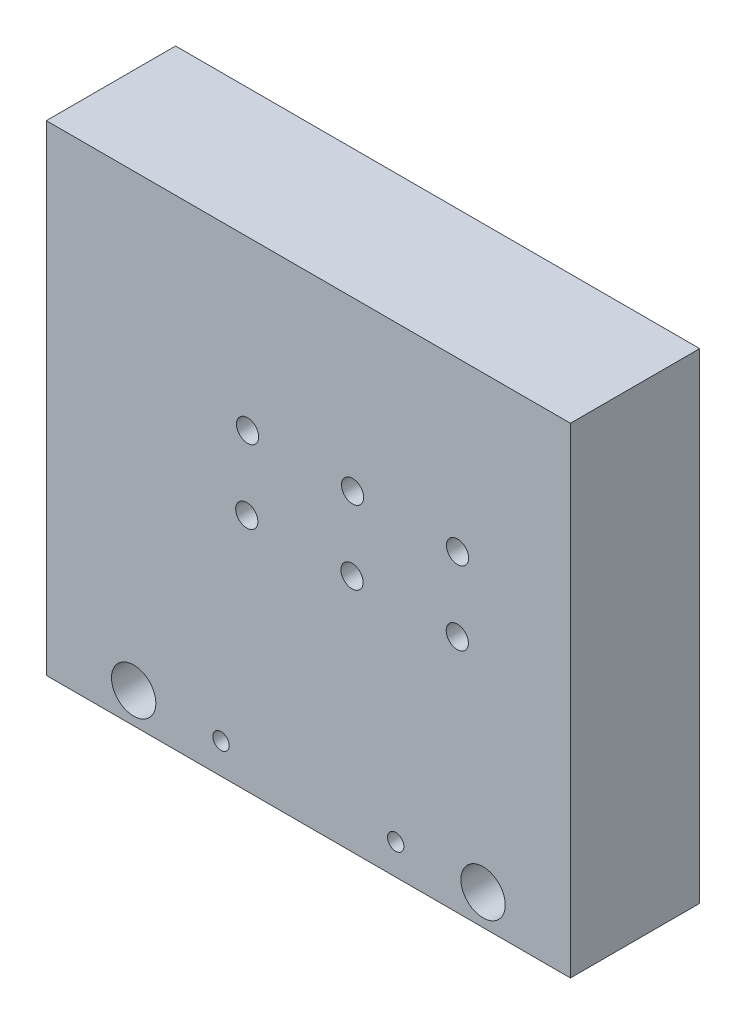
ISO-10303-21;
HEADER;
FILE_DESCRIPTION(('STEP AP214'),'2;1');
FILE_NAME('part.step','',(''),(''),'','','');
FILE_SCHEMA(('AUTOMOTIVE_DESIGN { 1 0 10303 214 1 1 1 1 }'));
ENDSEC;
DATA;
#1=APPLICATION_CONTEXT('core data for automotive mechanical design processes');
#2=APPLICATION_PROTOCOL_DEFINITION('international standard','automotive_design',2000,#1);
#3=PRODUCT_CONTEXT('',#1,'mechanical');
#4=PRODUCT('Part','Part','',(#3));
#5=PRODUCT_RELATED_PRODUCT_CATEGORY('part','',(#4));
#6=PRODUCT_DEFINITION_FORMATION('','',#4);
#7=PRODUCT_DEFINITION_CONTEXT('part definition',#1,'design');
#8=PRODUCT_DEFINITION('design','',#6,#7);
#9=PRODUCT_DEFINITION_SHAPE('','',#8);
#10=(LENGTH_UNIT() NAMED_UNIT(*) SI_UNIT(.MILLI.,.METRE.));
#11=(NAMED_UNIT(*) PLANE_ANGLE_UNIT() SI_UNIT($,.RADIAN.));
#12=(NAMED_UNIT(*) SI_UNIT($,.STERADIAN.) SOLID_ANGLE_UNIT());
#13=UNCERTAINTY_MEASURE_WITH_UNIT(LENGTH_MEASURE(1.E-05),#10,'distance_accuracy_value','');
#14=(GEOMETRIC_REPRESENTATION_CONTEXT(3) GLOBAL_UNCERTAINTY_ASSIGNED_CONTEXT((#13)) GLOBAL_UNIT_ASSIGNED_CONTEXT((#10,
#11,#12)) REPRESENTATION_CONTEXT('',''));
#15=CARTESIAN_POINT('',(0.,0.,0.));
#16=DIRECTION('',(0.,0.,1.));
#17=DIRECTION('',(1.,0.,0.));
#18=AXIS2_PLACEMENT_3D('',#15,#16,#17);
#19=CARTESIAN_POINT('',(0.,0.,74.));
#20=DIRECTION('',(0.,0.,1.));
#21=DIRECTION('',(1.,0.,0.));
#22=AXIS2_PLACEMENT_3D('',#19,#20,#21);
#23=PLANE('',#22);
#24=CARTESIAN_POINT('',(235.249999999999,136.750000000002,74.));
#25=DIRECTION('',(0.,0.,-1.));
#26=DIRECTION('',(-1.,0.,0.));
#27=AXIS2_PLACEMENT_3D('',#24,#25,#26);
#28=CIRCLE('',#27,6.34999999999999);
#29=CARTESIAN_POINT('',(228.899999999999,136.750000000002,74.));
#30=VERTEX_POINT('',#29);
#31=EDGE_CURVE('E486',#30,#30,#28,.T.);
#32=ORIENTED_EDGE('',*,*,#31,.T.);
#33=EDGE_LOOP('',(#32));
#34=FACE_BOUND('',#33,.T.);
#35=CARTESIAN_POINT('',(235.403635347868,178.999720663929,74.));
#36=DIRECTION('',(0.,0.,-1.));
#37=DIRECTION('',(-1.,0.,0.));
#38=AXIS2_PLACEMENT_3D('',#35,#36,#37);
#39=CIRCLE('',#38,6.34999999999999);
#40=CARTESIAN_POINT('',(229.053635347868,178.999720663929,74.));
#41=VERTEX_POINT('',#40);
#42=EDGE_CURVE('E497',#41,#41,#39,.T.);
#43=ORIENTED_EDGE('',*,*,#42,.T.);
#44=EDGE_LOOP('',(#43));
#45=FACE_BOUND('',#44,.T.);
#46=CARTESIAN_POINT('',(175.307264601373,178.998882688952,74.));
#47=DIRECTION('',(0.,0.,-1.));
#48=DIRECTION('',(-1.,0.,0.));
#49=AXIS2_PLACEMENT_3D('',#46,#47,#48);
#50=CIRCLE('',#49,6.34999999999999);
#51=CARTESIAN_POINT('',(168.957264601373,178.998882688952,74.));
#52=VERTEX_POINT('',#51);
#53=EDGE_CURVE('E469',#52,#52,#50,.T.);
#54=ORIENTED_EDGE('',*,*,#53,.T.);
#55=EDGE_LOOP('',(#54));
#56=FACE_BOUND('',#55,.T.);
#57=CARTESIAN_POINT('',(115.21088166736,178.997486174786,74.));
#58=DIRECTION('',(0.,0.,-1.));
#59=DIRECTION('',(-1.,0.,0.));
#60=AXIS2_PLACEMENT_3D('',#57,#58,#59);
#61=CIRCLE('',#60,6.34999999999999);
#62=CARTESIAN_POINT('',(108.86088166736,178.997486174786,74.));
#63=VERTEX_POINT('',#62);
#64=EDGE_CURVE('E470',#63,#63,#61,.T.);
#65=ORIENTED_EDGE('',*,*,#64,.T.);
#66=EDGE_LOOP('',(#65));
#67=FACE_BOUND('',#66,.T.);
#68=CARTESIAN_POINT('',(114.749999999999,136.750000000001,74.));
#69=DIRECTION('',(0.,0.,-1.));
#70=DIRECTION('',(-1.,0.,0.));
#71=AXIS2_PLACEMENT_3D('',#68,#69,#70);
#72=CIRCLE('',#71,6.34999999999999);
#73=CARTESIAN_POINT('',(108.399999999999,136.750000000001,74.));
#74=VERTEX_POINT('',#73);
#75=EDGE_CURVE('E492',#74,#74,#72,.T.);
#76=ORIENTED_EDGE('',*,*,#75,.T.);
#77=EDGE_LOOP('',(#76));
#78=FACE_BOUND('',#77,.T.);
#79=CARTESIAN_POINT('',(174.999999999999,136.750000000001,74.));
#80=DIRECTION('',(0.,0.,-1.));
#81=DIRECTION('',(-1.,0.,0.));
#82=AXIS2_PLACEMENT_3D('',#79,#80,#81);
#83=CIRCLE('',#82,6.34999999999999);
#84=CARTESIAN_POINT('',(168.649999999999,136.750000000001,74.));
#85=VERTEX_POINT('',#84);
#86=EDGE_CURVE('E156',#85,#85,#83,.T.);
#87=ORIENTED_EDGE('',*,*,#86,.T.);
#88=EDGE_LOOP('',(#87));
#89=FACE_BOUND('',#88,.T.);
#90=CARTESIAN_POINT('',(49.9999999999999,17.5000000000004,74.));
#91=DIRECTION('',(0.,0.,1.));
#92=DIRECTION('',(1.,0.,0.));
#93=AXIS2_PLACEMENT_3D('',#90,#91,#92);
#94=CIRCLE('',#93,12.7000000000003);
#95=CARTESIAN_POINT('',(62.7000000000002,17.5000000000004,74.));
#96=VERTEX_POINT('',#95);
#97=EDGE_CURVE('E168',#96,#96,#94,.T.);
#98=ORIENTED_EDGE('',*,*,#97,.F.);
#99=EDGE_LOOP('',(#98));
#100=FACE_BOUND('',#99,.T.);
#101=CARTESIAN_POINT('',(200.,17.5000000000016,74.));
#102=DIRECTION('',(0.,0.,1.));
#103=DIRECTION('',(1.,0.,0.));
#104=AXIS2_PLACEMENT_3D('',#101,#102,#103);
#105=CIRCLE('',#104,4.67500000000002);
#106=CARTESIAN_POINT('',(204.675,17.5000000000016,74.));
#107=VERTEX_POINT('',#106);
#108=EDGE_CURVE('E180',#107,#107,#105,.T.);
#109=ORIENTED_EDGE('',*,*,#108,.F.);
#110=EDGE_LOOP('',(#109));
#111=FACE_BOUND('',#110,.T.);
#112=DIRECTION('',(1.,0.,0.));
#113=VECTOR('',#112,1.);
#114=CARTESIAN_POINT('',(300.,1.99840144432528E-12,74.));
#115=LINE('',#114,#113);
#116=CARTESIAN_POINT('',(0.,0.,74.));
#117=VERTEX_POINT('',#116);
#118=CARTESIAN_POINT('',(300.,1.99840144432528E-12,74.));
#119=VERTEX_POINT('',#118);
#120=EDGE_CURVE('E105',#117,#119,#115,.T.);
#121=ORIENTED_EDGE('',*,*,#120,.T.);
#122=DIRECTION('',(0.,1.,0.));
#123=VECTOR('',#122,1.);
#124=CARTESIAN_POINT('',(300.000000000008,275.,74.));
#125=LINE('',#124,#123);
#126=CARTESIAN_POINT('',(300.000000000008,275.,74.));
#127=VERTEX_POINT('',#126);
#128=EDGE_CURVE('E100',#119,#127,#125,.T.);
#129=ORIENTED_EDGE('',*,*,#128,.T.);
#130=DIRECTION('',(-1.,0.,0.));
#131=VECTOR('',#130,1.);
#132=CARTESIAN_POINT('',(300.000000000008,275.,74.));
#133=LINE('',#132,#131);
#134=CARTESIAN_POINT('',(-1.93826436382475E-12,275.,74.));
#135=VERTEX_POINT('',#134);
#136=EDGE_CURVE('E103',#127,#135,#133,.T.);
#137=ORIENTED_EDGE('',*,*,#136,.T.);
#138=DIRECTION('',(0.,-1.,0.));
#139=VECTOR('',#138,1.);
#140=CARTESIAN_POINT('',(-1.93826436382475E-12,275.,74.));
#141=LINE('',#140,#139);
#142=EDGE_CURVE('E70',#135,#117,#141,.T.);
#143=ORIENTED_EDGE('',*,*,#142,.T.);
#144=EDGE_LOOP('',(#121,#129,#137,#143));
#145=FACE_BOUND('',#144,.T.);
#146=CARTESIAN_POINT('',(250.,17.5000000000015,74.));
#147=DIRECTION('',(0.,0.,1.));
#148=DIRECTION('',(1.,0.,0.));
#149=AXIS2_PLACEMENT_3D('',#146,#147,#148);
#150=CIRCLE('',#149,12.7000000000001);
#151=CARTESIAN_POINT('',(262.7,17.5000000000015,74.));
#152=VERTEX_POINT('',#151);
#153=EDGE_CURVE('E186',#152,#152,#150,.T.);
#154=ORIENTED_EDGE('',*,*,#153,.F.);
#155=EDGE_LOOP('',(#154));
#156=FACE_BOUND('',#155,.T.);
#157=CARTESIAN_POINT('',(99.9999999999998,17.5000000000011,74.));
#158=DIRECTION('',(0.,0.,1.));
#159=DIRECTION('',(1.,0.,0.));
#160=AXIS2_PLACEMENT_3D('',#157,#158,#159);
#161=CIRCLE('',#160,4.67499999999999);
#162=CARTESIAN_POINT('',(104.675,17.5000000000011,74.));
#163=VERTEX_POINT('',#162);
#164=EDGE_CURVE('E174',#163,#163,#161,.T.);
#165=ORIENTED_EDGE('',*,*,#164,.F.);
#166=EDGE_LOOP('',(#165));
#167=FACE_BOUND('',#166,.T.);
#168=ADVANCED_FACE('F51',(#34,#45,#56,#67,#78,#89,#100,#111,#145,#156,#167),#23,.T.);
#169=CARTESIAN_POINT('',(0.,0.,0.));
#170=DIRECTION('',(0.,0.,1.));
#171=DIRECTION('',(1.,0.,0.));
#172=AXIS2_PLACEMENT_3D('',#169,#170,#171);
#173=PLANE('',#172);
#174=DIRECTION('',(1.,0.,0.));
#175=VECTOR('',#174,1.);
#176=CARTESIAN_POINT('',(300.,1.99840144432528E-12,0.));
#177=LINE('',#176,#175);
#178=CARTESIAN_POINT('',(0.,0.,0.));
#179=VERTEX_POINT('',#178);
#180=CARTESIAN_POINT('',(300.,1.99840144432528E-12,0.));
#181=VERTEX_POINT('',#180);
#182=EDGE_CURVE('E118',#179,#181,#177,.T.);
#183=ORIENTED_EDGE('',*,*,#182,.F.);
#184=DIRECTION('',(0.,-1.,0.));
#185=VECTOR('',#184,1.);
#186=CARTESIAN_POINT('',(-1.93826436382475E-12,275.,0.));
#187=LINE('',#186,#185);
#188=CARTESIAN_POINT('',(-1.93826436382475E-12,275.,0.));
#189=VERTEX_POINT('',#188);
#190=EDGE_CURVE('E93',#189,#179,#187,.T.);
#191=ORIENTED_EDGE('',*,*,#190,.F.);
#192=DIRECTION('',(-1.,0.,0.));
#193=VECTOR('',#192,1.);
#194=CARTESIAN_POINT('',(300.000000000008,275.,0.));
#195=LINE('',#194,#193);
#196=CARTESIAN_POINT('',(300.000000000008,275.,0.));
#197=VERTEX_POINT('',#196);
#198=EDGE_CURVE('E87',#197,#189,#195,.T.);
#199=ORIENTED_EDGE('',*,*,#198,.F.);
#200=DIRECTION('',(0.,1.,0.));
#201=VECTOR('',#200,1.);
#202=CARTESIAN_POINT('',(300.000000000008,275.,0.));
#203=LINE('',#202,#201);
#204=EDGE_CURVE('E109',#181,#197,#203,.T.);
#205=ORIENTED_EDGE('',*,*,#204,.F.);
#206=EDGE_LOOP('',(#183,#191,#199,#205));
#207=FACE_BOUND('',#206,.T.);
#208=CARTESIAN_POINT('',(115.21088166736,178.997486174786,0.));
#209=DIRECTION('',(0.,0.,1.));
#210=DIRECTION('',(1.,0.,0.));
#211=AXIS2_PLACEMENT_3D('',#208,#209,#210);
#212=CIRCLE('',#211,3.00000000000001);
#213=CARTESIAN_POINT('',(118.21088166736,178.997486174786,0.));
#214=VERTEX_POINT('',#213);
#215=EDGE_CURVE('E121',#214,#214,#212,.T.);
#216=ORIENTED_EDGE('',*,*,#215,.T.);
#217=EDGE_LOOP('',(#216));
#218=FACE_BOUND('',#217,.T.);
#219=CARTESIAN_POINT('',(250.,17.5000000000015,0.));
#220=DIRECTION('',(0.,0.,1.));
#221=DIRECTION('',(1.,0.,0.));
#222=AXIS2_PLACEMENT_3D('',#219,#220,#221);
#223=CIRCLE('',#222,12.7000000000001);
#224=CARTESIAN_POINT('',(262.7,17.5000000000015,0.));
#225=VERTEX_POINT('',#224);
#226=EDGE_CURVE('E183',#225,#225,#223,.T.);
#227=ORIENTED_EDGE('',*,*,#226,.T.);
#228=EDGE_LOOP('',(#227));
#229=FACE_BOUND('',#228,.T.);
#230=CARTESIAN_POINT('',(200.,17.5000000000016,0.));
#231=DIRECTION('',(0.,0.,1.));
#232=DIRECTION('',(1.,0.,0.));
#233=AXIS2_PLACEMENT_3D('',#230,#231,#232);
#234=CIRCLE('',#233,4.67500000000002);
#235=CARTESIAN_POINT('',(204.675,17.5000000000016,0.));
#236=VERTEX_POINT('',#235);
#237=EDGE_CURVE('E177',#236,#236,#234,.T.);
#238=ORIENTED_EDGE('',*,*,#237,.T.);
#239=EDGE_LOOP('',(#238));
#240=FACE_BOUND('',#239,.T.);
#241=CARTESIAN_POINT('',(99.9999999999998,17.5000000000011,0.));
#242=DIRECTION('',(0.,0.,1.));
#243=DIRECTION('',(1.,0.,0.));
#244=AXIS2_PLACEMENT_3D('',#241,#242,#243);
#245=CIRCLE('',#244,4.67499999999999);
#246=CARTESIAN_POINT('',(104.675,17.5000000000011,0.));
#247=VERTEX_POINT('',#246);
#248=EDGE_CURVE('E171',#247,#247,#245,.T.);
#249=ORIENTED_EDGE('',*,*,#248,.T.);
#250=EDGE_LOOP('',(#249));
#251=FACE_BOUND('',#250,.T.);
#252=CARTESIAN_POINT('',(49.9999999999999,17.5000000000004,0.));
#253=DIRECTION('',(0.,0.,1.));
#254=DIRECTION('',(1.,0.,0.));
#255=AXIS2_PLACEMENT_3D('',#252,#253,#254);
#256=CIRCLE('',#255,12.7000000000003);
#257=CARTESIAN_POINT('',(62.7000000000002,17.5000000000004,0.));
#258=VERTEX_POINT('',#257);
#259=EDGE_CURVE('E167',#258,#258,#256,.T.);
#260=ORIENTED_EDGE('',*,*,#259,.T.);
#261=EDGE_LOOP('',(#260));
#262=FACE_BOUND('',#261,.T.);
#263=CARTESIAN_POINT('',(235.249999999999,136.750000000002,0.));
#264=DIRECTION('',(0.,0.,1.));
#265=DIRECTION('',(1.,0.,0.));
#266=AXIS2_PLACEMENT_3D('',#263,#264,#265);
#267=CIRCLE('',#266,2.99999999999999);
#268=CARTESIAN_POINT('',(238.249999999999,136.750000000002,0.));
#269=VERTEX_POINT('',#268);
#270=EDGE_CURVE('E164',#269,#269,#267,.T.);
#271=ORIENTED_EDGE('',*,*,#270,.T.);
#272=EDGE_LOOP('',(#271));
#273=FACE_BOUND('',#272,.T.);
#274=CARTESIAN_POINT('',(114.749999999999,136.750000000001,0.));
#275=DIRECTION('',(0.,0.,1.));
#276=DIRECTION('',(1.,0.,0.));
#277=AXIS2_PLACEMENT_3D('',#274,#275,#276);
#278=CIRCLE('',#277,3.00000000000001);
#279=CARTESIAN_POINT('',(117.749999999999,136.750000000001,0.));
#280=VERTEX_POINT('',#279);
#281=EDGE_CURVE('E161',#280,#280,#278,.T.);
#282=ORIENTED_EDGE('',*,*,#281,.T.);
#283=EDGE_LOOP('',(#282));
#284=FACE_BOUND('',#283,.T.);
#285=CARTESIAN_POINT('',(174.999999999999,136.750000000001,0.));
#286=DIRECTION('',(0.,0.,1.));
#287=DIRECTION('',(1.,0.,0.));
#288=AXIS2_PLACEMENT_3D('',#285,#286,#287);
#289=CIRCLE('',#288,2.99999999999999);
#290=CARTESIAN_POINT('',(177.999999999999,136.750000000001,0.));
#291=VERTEX_POINT('',#290);
#292=EDGE_CURVE('E153',#291,#291,#289,.T.);
#293=ORIENTED_EDGE('',*,*,#292,.T.);
#294=EDGE_LOOP('',(#293));
#295=FACE_BOUND('',#294,.T.);
#296=CARTESIAN_POINT('',(175.307264601373,178.998882688952,0.));
#297=DIRECTION('',(0.,0.,1.));
#298=DIRECTION('',(1.,0.,0.));
#299=AXIS2_PLACEMENT_3D('',#296,#297,#298);
#300=CIRCLE('',#299,2.99999999999999);
#301=CARTESIAN_POINT('',(178.307264601373,178.998882688952,0.));
#302=VERTEX_POINT('',#301);
#303=EDGE_CURVE('E148',#302,#302,#300,.T.);
#304=ORIENTED_EDGE('',*,*,#303,.T.);
#305=EDGE_LOOP('',(#304));
#306=FACE_BOUND('',#305,.T.);
#307=CARTESIAN_POINT('',(235.403635347868,178.999720663929,0.));
#308=DIRECTION('',(0.,0.,1.));
#309=DIRECTION('',(1.,0.,0.));
#310=AXIS2_PLACEMENT_3D('',#307,#308,#309);
#311=CIRCLE('',#310,2.99999999999999);
#312=CARTESIAN_POINT('',(238.403635347868,178.999720663929,0.));
#313=VERTEX_POINT('',#312);
#314=EDGE_CURVE('E144',#313,#313,#311,.T.);
#315=ORIENTED_EDGE('',*,*,#314,.T.);
#316=EDGE_LOOP('',(#315));
#317=FACE_BOUND('',#316,.T.);
#318=ADVANCED_FACE('F194',(#207,#218,#229,#240,#251,#262,#273,#284,#295,#306,#317),#173,.F.);
#319=CARTESIAN_POINT('',(300.,1.99840144432528E-12,74.));
#320=DIRECTION('',(0.,1.,0.));
#321=DIRECTION('',(-1.,0.,0.));
#322=AXIS2_PLACEMENT_3D('',#319,#320,#321);
#323=PLANE('',#322);
#324=ORIENTED_EDGE('',*,*,#182,.T.);
#325=DIRECTION('',(0.,0.,-1.));
#326=VECTOR('',#325,1.);
#327=CARTESIAN_POINT('',(300.,1.99840144432528E-12,74.));
#328=LINE('',#327,#326);
#329=EDGE_CURVE('E13',#119,#181,#328,.T.);
#330=ORIENTED_EDGE('',*,*,#329,.F.);
#331=ORIENTED_EDGE('',*,*,#120,.F.);
#332=DIRECTION('',(0.,0.,-1.));
#333=VECTOR('',#332,1.);
#334=CARTESIAN_POINT('',(0.,0.,74.));
#335=LINE('',#334,#333);
#336=EDGE_CURVE('E114',#117,#179,#335,.T.);
#337=ORIENTED_EDGE('',*,*,#336,.T.);
#338=EDGE_LOOP('',(#324,#330,#331,#337));
#339=FACE_BOUND('',#338,.T.);
#340=ADVANCED_FACE('F53',(#339),#323,.F.);
#341=CARTESIAN_POINT('',(300.000000000008,275.,74.));
#342=DIRECTION('',(-1.,0.,0.));
#343=DIRECTION('',(0.,-1.,0.));
#344=AXIS2_PLACEMENT_3D('',#341,#342,#343);
#345=PLANE('',#344);
#346=ORIENTED_EDGE('',*,*,#204,.T.);
#347=DIRECTION('',(0.,0.,-1.));
#348=VECTOR('',#347,1.);
#349=CARTESIAN_POINT('',(300.000000000008,275.,74.));
#350=LINE('',#349,#348);
#351=EDGE_CURVE('E61',#127,#197,#350,.T.);
#352=ORIENTED_EDGE('',*,*,#351,.F.);
#353=ORIENTED_EDGE('',*,*,#128,.F.);
#354=ORIENTED_EDGE('',*,*,#329,.T.);
#355=EDGE_LOOP('',(#346,#352,#353,#354));
#356=FACE_BOUND('',#355,.T.);
#357=ADVANCED_FACE('F108',(#356),#345,.F.);
#358=CARTESIAN_POINT('',(300.000000000008,275.,74.));
#359=DIRECTION('',(0.,-1.,0.));
#360=DIRECTION('',(1.,0.,0.));
#361=AXIS2_PLACEMENT_3D('',#358,#359,#360);
#362=PLANE('',#361);
#363=ORIENTED_EDGE('',*,*,#198,.T.);
#364=DIRECTION('',(0.,0.,-1.));
#365=VECTOR('',#364,1.);
#366=CARTESIAN_POINT('',(-1.93826436382475E-12,275.,74.));
#367=LINE('',#366,#365);
#368=EDGE_CURVE('E110',#135,#189,#367,.T.);
#369=ORIENTED_EDGE('',*,*,#368,.F.);
#370=ORIENTED_EDGE('',*,*,#136,.F.);
#371=ORIENTED_EDGE('',*,*,#351,.T.);
#372=EDGE_LOOP('',(#363,#369,#370,#371));
#373=FACE_BOUND('',#372,.T.);
#374=ADVANCED_FACE('F112',(#373),#362,.F.);
#375=CARTESIAN_POINT('',(-1.93826436382475E-12,275.,74.));
#376=DIRECTION('',(1.,0.,0.));
#377=DIRECTION('',(0.,1.,0.));
#378=AXIS2_PLACEMENT_3D('',#375,#376,#377);
#379=PLANE('',#378);
#380=ORIENTED_EDGE('',*,*,#190,.T.);
#381=ORIENTED_EDGE('',*,*,#336,.F.);
#382=ORIENTED_EDGE('',*,*,#142,.F.);
#383=ORIENTED_EDGE('',*,*,#368,.T.);
#384=EDGE_LOOP('',(#380,#381,#382,#383));
#385=FACE_BOUND('',#384,.T.);
#386=ADVANCED_FACE('F200',(#385),#379,.F.);
#387=CARTESIAN_POINT('',(115.21088166736,178.997486174786,74.));
#388=DIRECTION('',(0.,0.,-1.));
#389=DIRECTION('',(-1.,0.,0.));
#390=AXIS2_PLACEMENT_3D('',#387,#388,#389);
#391=CYLINDRICAL_SURFACE('',#390,3.00000000000001);
#392=CARTESIAN_POINT('',(115.21088166736,178.997486174786,29.));
#393=DIRECTION('',(0.,0.,-1.));
#394=DIRECTION('',(-1.,0.,0.));
#395=AXIS2_PLACEMENT_3D('',#392,#393,#394);
#396=CIRCLE('',#395,3.00000000000001);
#397=CARTESIAN_POINT('',(112.21088166736,178.997486174786,29.));
#398=VERTEX_POINT('',#397);
#399=EDGE_CURVE('E55',#398,#398,#396,.T.);
#400=ORIENTED_EDGE('',*,*,#399,.F.);
#401=EDGE_LOOP('',(#400));
#402=FACE_BOUND('',#401,.T.);
#403=ORIENTED_EDGE('',*,*,#215,.F.);
#404=EDGE_LOOP('',(#403));
#405=FACE_BOUND('',#404,.T.);
#406=ADVANCED_FACE('F197',(#402,#405),#391,.F.);
#407=CARTESIAN_POINT('',(250.,17.5000000000015,74.));
#408=DIRECTION('',(0.,0.,-1.));
#409=DIRECTION('',(-1.,0.,0.));
#410=AXIS2_PLACEMENT_3D('',#407,#408,#409);
#411=CYLINDRICAL_SURFACE('',#410,12.7000000000001);
#412=ORIENTED_EDGE('',*,*,#153,.T.);
#413=EDGE_LOOP('',(#412));
#414=FACE_BOUND('',#413,.T.);
#415=ORIENTED_EDGE('',*,*,#226,.F.);
#416=EDGE_LOOP('',(#415));
#417=FACE_BOUND('',#416,.T.);
#418=ADVANCED_FACE('F199',(#414,#417),#411,.F.);
#419=CARTESIAN_POINT('',(200.,17.5000000000016,74.));
#420=DIRECTION('',(0.,0.,-1.));
#421=DIRECTION('',(-1.,0.,0.));
#422=AXIS2_PLACEMENT_3D('',#419,#420,#421);
#423=CYLINDRICAL_SURFACE('',#422,4.67500000000002);
#424=ORIENTED_EDGE('',*,*,#108,.T.);
#425=EDGE_LOOP('',(#424));
#426=FACE_BOUND('',#425,.T.);
#427=ORIENTED_EDGE('',*,*,#237,.F.);
#428=EDGE_LOOP('',(#427));
#429=FACE_BOUND('',#428,.T.);
#430=ADVANCED_FACE('F207',(#426,#429),#423,.F.);
#431=CARTESIAN_POINT('',(99.9999999999998,17.5000000000011,74.));
#432=DIRECTION('',(0.,0.,-1.));
#433=DIRECTION('',(-1.,0.,0.));
#434=AXIS2_PLACEMENT_3D('',#431,#432,#433);
#435=CYLINDRICAL_SURFACE('',#434,4.67499999999999);
#436=ORIENTED_EDGE('',*,*,#164,.T.);
#437=EDGE_LOOP('',(#436));
#438=FACE_BOUND('',#437,.T.);
#439=ORIENTED_EDGE('',*,*,#248,.F.);
#440=EDGE_LOOP('',(#439));
#441=FACE_BOUND('',#440,.T.);
#442=ADVANCED_FACE('F274',(#438,#441),#435,.F.);
#443=CARTESIAN_POINT('',(49.9999999999999,17.5000000000004,74.));
#444=DIRECTION('',(0.,0.,-1.));
#445=DIRECTION('',(-1.,0.,0.));
#446=AXIS2_PLACEMENT_3D('',#443,#444,#445);
#447=CYLINDRICAL_SURFACE('',#446,12.7000000000003);
#448=ORIENTED_EDGE('',*,*,#97,.T.);
#449=EDGE_LOOP('',(#448));
#450=FACE_BOUND('',#449,.T.);
#451=ORIENTED_EDGE('',*,*,#259,.F.);
#452=EDGE_LOOP('',(#451));
#453=FACE_BOUND('',#452,.T.);
#454=ADVANCED_FACE('F283',(#450,#453),#447,.F.);
#455=CARTESIAN_POINT('',(235.249999999999,136.750000000002,74.));
#456=DIRECTION('',(0.,0.,-1.));
#457=DIRECTION('',(-1.,0.,0.));
#458=AXIS2_PLACEMENT_3D('',#455,#456,#457);
#459=CYLINDRICAL_SURFACE('',#458,2.99999999999999);
#460=CARTESIAN_POINT('',(235.249999999999,136.750000000002,29.));
#461=DIRECTION('',(0.,0.,-1.));
#462=DIRECTION('',(-1.,0.,0.));
#463=AXIS2_PLACEMENT_3D('',#460,#461,#462);
#464=CIRCLE('',#463,2.99999999999999);
#465=CARTESIAN_POINT('',(232.249999999999,136.750000000002,29.));
#466=VERTEX_POINT('',#465);
#467=EDGE_CURVE('E139',#466,#466,#464,.T.);
#468=ORIENTED_EDGE('',*,*,#467,.F.);
#469=EDGE_LOOP('',(#468));
#470=FACE_BOUND('',#469,.T.);
#471=ORIENTED_EDGE('',*,*,#270,.F.);
#472=EDGE_LOOP('',(#471));
#473=FACE_BOUND('',#472,.T.);
#474=ADVANCED_FACE('F292',(#470,#473),#459,.F.);
#475=CARTESIAN_POINT('',(114.749999999999,136.750000000001,74.));
#476=DIRECTION('',(0.,0.,-1.));
#477=DIRECTION('',(-1.,0.,0.));
#478=AXIS2_PLACEMENT_3D('',#475,#476,#477);
#479=CYLINDRICAL_SURFACE('',#478,3.00000000000001);
#480=CARTESIAN_POINT('',(114.749999999999,136.750000000001,29.));
#481=DIRECTION('',(0.,0.,-1.));
#482=DIRECTION('',(-1.,0.,0.));
#483=AXIS2_PLACEMENT_3D('',#480,#481,#482);
#484=CIRCLE('',#483,3.00000000000001);
#485=CARTESIAN_POINT('',(111.749999999999,136.750000000001,29.));
#486=VERTEX_POINT('',#485);
#487=EDGE_CURVE('E137',#486,#486,#484,.T.);
#488=ORIENTED_EDGE('',*,*,#487,.F.);
#489=EDGE_LOOP('',(#488));
#490=FACE_BOUND('',#489,.T.);
#491=ORIENTED_EDGE('',*,*,#281,.F.);
#492=EDGE_LOOP('',(#491));
#493=FACE_BOUND('',#492,.T.);
#494=ADVANCED_FACE('F300',(#490,#493),#479,.F.);
#495=CARTESIAN_POINT('',(174.999999999999,136.750000000001,74.));
#496=DIRECTION('',(0.,0.,-1.));
#497=DIRECTION('',(-1.,0.,0.));
#498=AXIS2_PLACEMENT_3D('',#495,#496,#497);
#499=CYLINDRICAL_SURFACE('',#498,2.99999999999999);
#500=CARTESIAN_POINT('',(174.999999999999,136.750000000001,29.));
#501=DIRECTION('',(0.,0.,-1.));
#502=DIRECTION('',(-1.,0.,0.));
#503=AXIS2_PLACEMENT_3D('',#500,#501,#502);
#504=CIRCLE('',#503,2.99999999999999);
#505=CARTESIAN_POINT('',(171.999999999999,136.750000000001,29.));
#506=VERTEX_POINT('',#505);
#507=EDGE_CURVE('E134',#506,#506,#504,.T.);
#508=ORIENTED_EDGE('',*,*,#507,.F.);
#509=EDGE_LOOP('',(#508));
#510=FACE_BOUND('',#509,.T.);
#511=ORIENTED_EDGE('',*,*,#292,.F.);
#512=EDGE_LOOP('',(#511));
#513=FACE_BOUND('',#512,.T.);
#514=ADVANCED_FACE('F309',(#510,#513),#499,.F.);
#515=CARTESIAN_POINT('',(175.307264601373,178.998882688952,74.));
#516=DIRECTION('',(0.,0.,-1.));
#517=DIRECTION('',(-1.,0.,0.));
#518=AXIS2_PLACEMENT_3D('',#515,#516,#517);
#519=CYLINDRICAL_SURFACE('',#518,2.99999999999999);
#520=CARTESIAN_POINT('',(175.307264601373,178.998882688952,29.));
#521=DIRECTION('',(0.,0.,-1.));
#522=DIRECTION('',(-1.,0.,0.));
#523=AXIS2_PLACEMENT_3D('',#520,#521,#522);
#524=CIRCLE('',#523,2.99999999999999);
#525=CARTESIAN_POINT('',(172.307264601373,178.998882688952,29.));
#526=VERTEX_POINT('',#525);
#527=EDGE_CURVE('E130',#526,#526,#524,.T.);
#528=ORIENTED_EDGE('',*,*,#527,.F.);
#529=EDGE_LOOP('',(#528));
#530=FACE_BOUND('',#529,.T.);
#531=ORIENTED_EDGE('',*,*,#303,.F.);
#532=EDGE_LOOP('',(#531));
#533=FACE_BOUND('',#532,.T.);
#534=ADVANCED_FACE('F318',(#530,#533),#519,.F.);
#535=CARTESIAN_POINT('',(235.403635347868,178.999720663929,74.));
#536=DIRECTION('',(0.,0.,-1.));
#537=DIRECTION('',(-1.,0.,0.));
#538=AXIS2_PLACEMENT_3D('',#535,#536,#537);
#539=CYLINDRICAL_SURFACE('',#538,2.99999999999999);
#540=CARTESIAN_POINT('',(235.403635347868,178.999720663929,29.));
#541=DIRECTION('',(0.,0.,-1.));
#542=DIRECTION('',(-1.,0.,0.));
#543=AXIS2_PLACEMENT_3D('',#540,#541,#542);
#544=CIRCLE('',#543,2.99999999999999);
#545=CARTESIAN_POINT('',(232.403635347868,178.999720663929,29.));
#546=VERTEX_POINT('',#545);
#547=EDGE_CURVE('E127',#546,#546,#544,.T.);
#548=ORIENTED_EDGE('',*,*,#547,.F.);
#549=EDGE_LOOP('',(#548));
#550=FACE_BOUND('',#549,.T.);
#551=ORIENTED_EDGE('',*,*,#314,.F.);
#552=EDGE_LOOP('',(#551));
#553=FACE_BOUND('',#552,.T.);
#554=ADVANCED_FACE('F327',(#550,#553),#539,.F.);
#555=CARTESIAN_POINT('',(235.403635347868,178.999720663929,29.));
#556=DIRECTION('',(0.,0.,1.));
#557=DIRECTION('',(1.,0.,0.));
#558=AXIS2_PLACEMENT_3D('',#555,#556,#557);
#559=CYLINDRICAL_SURFACE('',#558,6.34999999999999);
#560=CARTESIAN_POINT('',(235.403635347868,178.999720663929,29.));
#561=DIRECTION('',(0.,0.,-1.));
#562=DIRECTION('',(-1.,0.,0.));
#563=AXIS2_PLACEMENT_3D('',#560,#561,#562);
#564=CIRCLE('',#563,6.34999999999999);
#565=CARTESIAN_POINT('',(229.053635347868,178.999720663929,29.));
#566=VERTEX_POINT('',#565);
#567=EDGE_CURVE('E489',#566,#566,#564,.T.);
#568=ORIENTED_EDGE('',*,*,#567,.T.);
#569=EDGE_LOOP('',(#568));
#570=FACE_BOUND('',#569,.T.);
#571=ORIENTED_EDGE('',*,*,#42,.F.);
#572=EDGE_LOOP('',(#571));
#573=FACE_BOUND('',#572,.T.);
#574=ADVANCED_FACE('F336',(#570,#573),#559,.F.);
#575=CARTESIAN_POINT('',(235.403635347868,178.999720663929,29.));
#576=DIRECTION('',(0.,0.,-1.));
#577=DIRECTION('',(-1.,0.,0.));
#578=AXIS2_PLACEMENT_3D('',#575,#576,#577);
#579=PLANE('',#578);
#580=ORIENTED_EDGE('',*,*,#547,.T.);
#581=EDGE_LOOP('',(#580));
#582=FACE_BOUND('',#581,.T.);
#583=ORIENTED_EDGE('',*,*,#567,.F.);
#584=EDGE_LOOP('',(#583));
#585=FACE_BOUND('',#584,.T.);
#586=ADVANCED_FACE('F345',(#582,#585),#579,.F.);
#587=CARTESIAN_POINT('',(175.307264601373,178.998882688952,29.));
#588=DIRECTION('',(0.,0.,1.));
#589=DIRECTION('',(1.,0.,0.));
#590=AXIS2_PLACEMENT_3D('',#587,#588,#589);
#591=CYLINDRICAL_SURFACE('',#590,6.34999999999999);
#592=CARTESIAN_POINT('',(175.307264601373,178.998882688952,29.));
#593=DIRECTION('',(0.,0.,-1.));
#594=DIRECTION('',(-1.,0.,0.));
#595=AXIS2_PLACEMENT_3D('',#592,#593,#594);
#596=CIRCLE('',#595,6.34999999999999);
#597=CARTESIAN_POINT('',(168.957264601373,178.998882688952,29.));
#598=VERTEX_POINT('',#597);
#599=EDGE_CURVE('E473',#598,#598,#596,.T.);
#600=ORIENTED_EDGE('',*,*,#599,.T.);
#601=EDGE_LOOP('',(#600));
#602=FACE_BOUND('',#601,.T.);
#603=ORIENTED_EDGE('',*,*,#53,.F.);
#604=EDGE_LOOP('',(#603));
#605=FACE_BOUND('',#604,.T.);
#606=ADVANCED_FACE('F354',(#602,#605),#591,.F.);
#607=CARTESIAN_POINT('',(175.307264601373,178.998882688952,29.));
#608=DIRECTION('',(0.,0.,-1.));
#609=DIRECTION('',(-1.,0.,0.));
#610=AXIS2_PLACEMENT_3D('',#607,#608,#609);
#611=PLANE('',#610);
#612=ORIENTED_EDGE('',*,*,#527,.T.);
#613=EDGE_LOOP('',(#612));
#614=FACE_BOUND('',#613,.T.);
#615=ORIENTED_EDGE('',*,*,#599,.F.);
#616=EDGE_LOOP('',(#615));
#617=FACE_BOUND('',#616,.T.);
#618=ADVANCED_FACE('F363',(#614,#617),#611,.F.);
#619=CARTESIAN_POINT('',(174.999999999999,136.750000000001,29.));
#620=DIRECTION('',(0.,0.,1.));
#621=DIRECTION('',(1.,0.,0.));
#622=AXIS2_PLACEMENT_3D('',#619,#620,#621);
#623=CYLINDRICAL_SURFACE('',#622,6.34999999999999);
#624=CARTESIAN_POINT('',(174.999999999999,136.750000000001,29.));
#625=DIRECTION('',(0.,0.,-1.));
#626=DIRECTION('',(-1.,0.,0.));
#627=AXIS2_PLACEMENT_3D('',#624,#625,#626);
#628=CIRCLE('',#627,6.34999999999999);
#629=CARTESIAN_POINT('',(168.649999999999,136.750000000001,29.));
#630=VERTEX_POINT('',#629);
#631=EDGE_CURVE('E131',#630,#630,#628,.T.);
#632=ORIENTED_EDGE('',*,*,#631,.T.);
#633=EDGE_LOOP('',(#632));
#634=FACE_BOUND('',#633,.T.);
#635=ORIENTED_EDGE('',*,*,#86,.F.);
#636=EDGE_LOOP('',(#635));
#637=FACE_BOUND('',#636,.T.);
#638=ADVANCED_FACE('F372',(#634,#637),#623,.F.);
#639=CARTESIAN_POINT('',(174.999999999999,136.750000000001,29.));
#640=DIRECTION('',(0.,0.,-1.));
#641=DIRECTION('',(-1.,0.,0.));
#642=AXIS2_PLACEMENT_3D('',#639,#640,#641);
#643=PLANE('',#642);
#644=ORIENTED_EDGE('',*,*,#507,.T.);
#645=EDGE_LOOP('',(#644));
#646=FACE_BOUND('',#645,.T.);
#647=ORIENTED_EDGE('',*,*,#631,.F.);
#648=EDGE_LOOP('',(#647));
#649=FACE_BOUND('',#648,.T.);
#650=ADVANCED_FACE('F381',(#646,#649),#643,.F.);
#651=CARTESIAN_POINT('',(114.749999999999,136.750000000001,29.));
#652=DIRECTION('',(0.,0.,1.));
#653=DIRECTION('',(1.,0.,0.));
#654=AXIS2_PLACEMENT_3D('',#651,#652,#653);
#655=CYLINDRICAL_SURFACE('',#654,6.34999999999999);
#656=CARTESIAN_POINT('',(114.749999999999,136.750000000001,29.));
#657=DIRECTION('',(0.,0.,-1.));
#658=DIRECTION('',(-1.,0.,0.));
#659=AXIS2_PLACEMENT_3D('',#656,#657,#658);
#660=CIRCLE('',#659,6.34999999999999);
#661=CARTESIAN_POINT('',(108.399999999999,136.750000000001,29.));
#662=VERTEX_POINT('',#661);
#663=EDGE_CURVE('E476',#662,#662,#660,.T.);
#664=ORIENTED_EDGE('',*,*,#663,.T.);
#665=EDGE_LOOP('',(#664));
#666=FACE_BOUND('',#665,.T.);
#667=ORIENTED_EDGE('',*,*,#75,.F.);
#668=EDGE_LOOP('',(#667));
#669=FACE_BOUND('',#668,.T.);
#670=ADVANCED_FACE('F390',(#666,#669),#655,.F.);
#671=CARTESIAN_POINT('',(114.749999999999,136.750000000001,29.));
#672=DIRECTION('',(0.,0.,-1.));
#673=DIRECTION('',(-1.,0.,0.));
#674=AXIS2_PLACEMENT_3D('',#671,#672,#673);
#675=PLANE('',#674);
#676=ORIENTED_EDGE('',*,*,#487,.T.);
#677=EDGE_LOOP('',(#676));
#678=FACE_BOUND('',#677,.T.);
#679=ORIENTED_EDGE('',*,*,#663,.F.);
#680=EDGE_LOOP('',(#679));
#681=FACE_BOUND('',#680,.T.);
#682=ADVANCED_FACE('F399',(#678,#681),#675,.F.);
#683=CARTESIAN_POINT('',(235.249999999999,136.750000000002,29.));
#684=DIRECTION('',(0.,0.,1.));
#685=DIRECTION('',(1.,0.,0.));
#686=AXIS2_PLACEMENT_3D('',#683,#684,#685);
#687=CYLINDRICAL_SURFACE('',#686,6.34999999999999);
#688=CARTESIAN_POINT('',(235.249999999999,136.750000000002,29.));
#689=DIRECTION('',(0.,0.,-1.));
#690=DIRECTION('',(-1.,0.,0.));
#691=AXIS2_PLACEMENT_3D('',#688,#689,#690);
#692=CIRCLE('',#691,6.34999999999999);
#693=CARTESIAN_POINT('',(228.899999999999,136.750000000002,29.));
#694=VERTEX_POINT('',#693);
#695=EDGE_CURVE('E482',#694,#694,#692,.T.);
#696=ORIENTED_EDGE('',*,*,#695,.T.);
#697=EDGE_LOOP('',(#696));
#698=FACE_BOUND('',#697,.T.);
#699=ORIENTED_EDGE('',*,*,#31,.F.);
#700=EDGE_LOOP('',(#699));
#701=FACE_BOUND('',#700,.T.);
#702=ADVANCED_FACE('F408',(#698,#701),#687,.F.);
#703=CARTESIAN_POINT('',(235.249999999999,136.750000000002,29.));
#704=DIRECTION('',(0.,0.,-1.));
#705=DIRECTION('',(-1.,0.,0.));
#706=AXIS2_PLACEMENT_3D('',#703,#704,#705);
#707=PLANE('',#706);
#708=ORIENTED_EDGE('',*,*,#467,.T.);
#709=EDGE_LOOP('',(#708));
#710=FACE_BOUND('',#709,.T.);
#711=ORIENTED_EDGE('',*,*,#695,.F.);
#712=EDGE_LOOP('',(#711));
#713=FACE_BOUND('',#712,.T.);
#714=ADVANCED_FACE('F417',(#710,#713),#707,.F.);
#715=CARTESIAN_POINT('',(115.21088166736,178.997486174786,29.));
#716=DIRECTION('',(0.,0.,1.));
#717=DIRECTION('',(1.,0.,0.));
#718=AXIS2_PLACEMENT_3D('',#715,#716,#717);
#719=CYLINDRICAL_SURFACE('',#718,6.34999999999999);
#720=CARTESIAN_POINT('',(115.21088166736,178.997486174786,29.));
#721=DIRECTION('',(0.,0.,-1.));
#722=DIRECTION('',(-1.,0.,0.));
#723=AXIS2_PLACEMENT_3D('',#720,#721,#722);
#724=CIRCLE('',#723,6.34999999999999);
#725=CARTESIAN_POINT('',(108.86088166736,178.997486174786,29.));
#726=VERTEX_POINT('',#725);
#727=EDGE_CURVE('E468',#726,#726,#724,.T.);
#728=ORIENTED_EDGE('',*,*,#727,.T.);
#729=EDGE_LOOP('',(#728));
#730=FACE_BOUND('',#729,.T.);
#731=ORIENTED_EDGE('',*,*,#64,.F.);
#732=EDGE_LOOP('',(#731));
#733=FACE_BOUND('',#732,.T.);
#734=ADVANCED_FACE('F426',(#730,#733),#719,.F.);
#735=CARTESIAN_POINT('',(115.21088166736,178.997486174786,29.));
#736=DIRECTION('',(0.,0.,-1.));
#737=DIRECTION('',(-1.,0.,0.));
#738=AXIS2_PLACEMENT_3D('',#735,#736,#737);
#739=PLANE('',#738);
#740=ORIENTED_EDGE('',*,*,#399,.T.);
#741=EDGE_LOOP('',(#740));
#742=FACE_BOUND('',#741,.T.);
#743=ORIENTED_EDGE('',*,*,#727,.F.);
#744=EDGE_LOOP('',(#743));
#745=FACE_BOUND('',#744,.T.);
#746=ADVANCED_FACE('F434',(#742,#745),#739,.F.);
#747=CLOSED_SHELL('',(#168,#318,#340,#357,#374,#386,#406,#418,#430,#442,#454,#474,#494,#514,
#534,#554,#574,#586,#606,#618,#638,#650,#670,#682,#702,#714,#734,#746));
#748=MANIFOLD_SOLID_BREP('B2',#747);
#749=ADVANCED_BREP_SHAPE_REPRESENTATION('',(#18,#748),#14);
#750=SHAPE_DEFINITION_REPRESENTATION(#9,#749);
ENDSEC;
END-ISO-10303-21;
